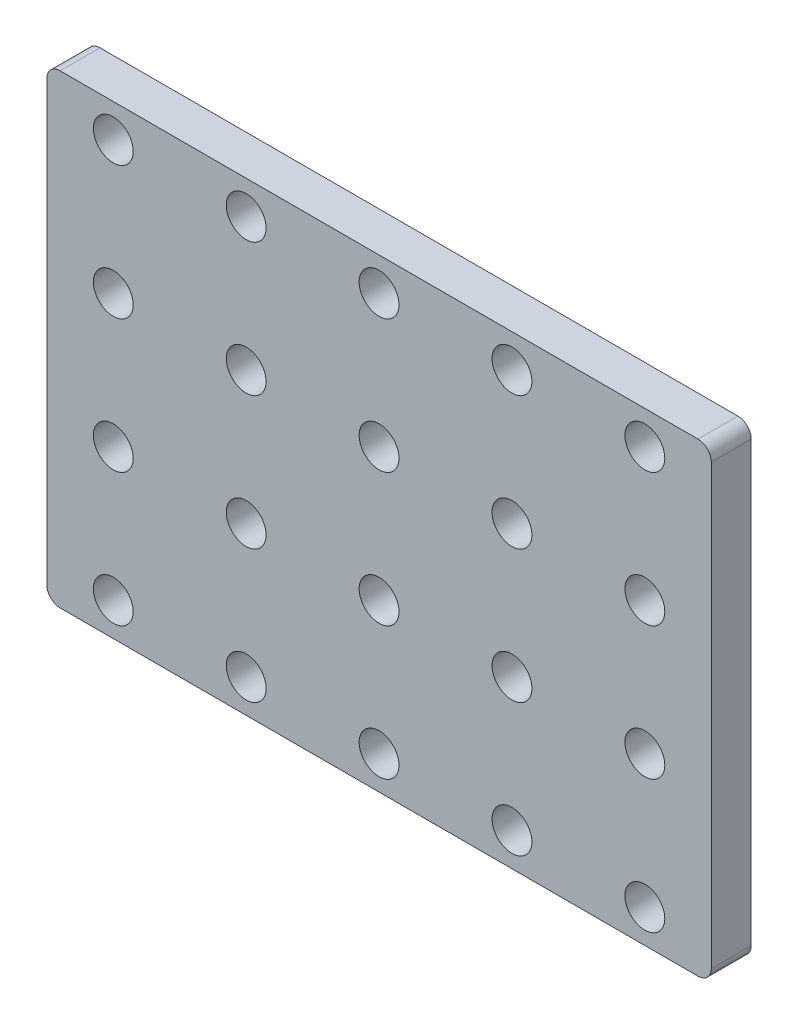
ISO-10303-21;
HEADER;
FILE_DESCRIPTION(('STEP AP214'),'2;1');
FILE_NAME('part.step','',(''),(''),'','','');
FILE_SCHEMA(('AUTOMOTIVE_DESIGN { 1 0 10303 214 1 1 1 1 }'));
ENDSEC;
DATA;
#1=APPLICATION_CONTEXT('core data for automotive mechanical design processes');
#2=APPLICATION_PROTOCOL_DEFINITION('international standard','automotive_design',2000,#1);
#3=PRODUCT_CONTEXT('',#1,'mechanical');
#4=PRODUCT('Part','Part','',(#3));
#5=PRODUCT_RELATED_PRODUCT_CATEGORY('part','',(#4));
#6=PRODUCT_DEFINITION_FORMATION('','',#4);
#7=PRODUCT_DEFINITION_CONTEXT('part definition',#1,'design');
#8=PRODUCT_DEFINITION('design','',#6,#7);
#9=PRODUCT_DEFINITION_SHAPE('','',#8);
#10=(LENGTH_UNIT() NAMED_UNIT(*) SI_UNIT(.MILLI.,.METRE.));
#11=(NAMED_UNIT(*) PLANE_ANGLE_UNIT() SI_UNIT($,.RADIAN.));
#12=(NAMED_UNIT(*) SI_UNIT($,.STERADIAN.) SOLID_ANGLE_UNIT());
#13=UNCERTAINTY_MEASURE_WITH_UNIT(LENGTH_MEASURE(1.E-05),#10,'distance_accuracy_value','');
#14=(GEOMETRIC_REPRESENTATION_CONTEXT(3) GLOBAL_UNCERTAINTY_ASSIGNED_CONTEXT((#13)) GLOBAL_UNIT_ASSIGNED_CONTEXT((#10,
#11,#12)) REPRESENTATION_CONTEXT('',''));
#15=CARTESIAN_POINT('',(0.,0.,0.));
#16=DIRECTION('',(0.,0.,1.));
#17=DIRECTION('',(1.,0.,0.));
#18=AXIS2_PLACEMENT_3D('',#15,#16,#17);
#19=CARTESIAN_POINT('',(0.,0.,3.));
#20=DIRECTION('',(1.,0.,0.));
#21=DIRECTION('',(0.,1.,0.));
#22=AXIS2_PLACEMENT_3D('',#19,#20,#21);
#23=PLANE('',#22);
#24=DIRECTION('',(0.,-1.,0.));
#25=VECTOR('',#24,1.);
#26=CARTESIAN_POINT('',(0.,0.,0.));
#27=LINE('',#26,#25);
#28=CARTESIAN_POINT('',(0.,34.,0.));
#29=VERTEX_POINT('',#28);
#30=CARTESIAN_POINT('',(0.,1.,0.));
#31=VERTEX_POINT('',#30);
#32=EDGE_CURVE('E136',#29,#31,#27,.T.);
#33=ORIENTED_EDGE('',*,*,#32,.T.);
#34=DIRECTION('',(0.,0.,-1.));
#35=VECTOR('',#34,1.);
#36=CARTESIAN_POINT('',(0.,1.,3.));
#37=LINE('',#36,#35);
#38=CARTESIAN_POINT('',(0.,1.,3.));
#39=VERTEX_POINT('',#38);
#40=EDGE_CURVE('E111',#31,#39,#37,.F.);
#41=ORIENTED_EDGE('',*,*,#40,.T.);
#42=DIRECTION('',(0.,-1.,0.));
#43=VECTOR('',#42,1.);
#44=CARTESIAN_POINT('',(0.,0.,3.));
#45=LINE('',#44,#43);
#46=CARTESIAN_POINT('',(0.,34.,3.));
#47=VERTEX_POINT('',#46);
#48=EDGE_CURVE('E149',#47,#39,#45,.T.);
#49=ORIENTED_EDGE('',*,*,#48,.F.);
#50=DIRECTION('',(0.,0.,-1.));
#51=VECTOR('',#50,1.);
#52=CARTESIAN_POINT('',(0.,34.,3.));
#53=LINE('',#52,#51);
#54=EDGE_CURVE('E117',#47,#29,#53,.T.);
#55=ORIENTED_EDGE('',*,*,#54,.T.);
#56=EDGE_LOOP('',(#33,#41,#49,#55));
#57=FACE_BOUND('',#56,.T.);
#58=ADVANCED_FACE('F39',(#57),#23,.F.);
#59=CARTESIAN_POINT('',(0.,0.,3.));
#60=DIRECTION('',(0.,1.,0.));
#61=DIRECTION('',(0.,0.,1.));
#62=AXIS2_PLACEMENT_3D('',#59,#60,#61);
#63=PLANE('',#62);
#64=DIRECTION('',(1.,0.,0.));
#65=VECTOR('',#64,1.);
#66=CARTESIAN_POINT('',(0.,0.,3.));
#67=LINE('',#66,#65);
#68=CARTESIAN_POINT('',(1.,0.,3.));
#69=VERTEX_POINT('',#68);
#70=CARTESIAN_POINT('',(49.,0.,3.));
#71=VERTEX_POINT('',#70);
#72=EDGE_CURVE('E127',#69,#71,#67,.T.);
#73=ORIENTED_EDGE('',*,*,#72,.F.);
#74=DIRECTION('',(0.,0.,-1.));
#75=VECTOR('',#74,1.);
#76=CARTESIAN_POINT('',(1.,0.,3.));
#77=LINE('',#76,#75);
#78=CARTESIAN_POINT('',(1.,0.,0.));
#79=VERTEX_POINT('',#78);
#80=EDGE_CURVE('E110',#69,#79,#77,.T.);
#81=ORIENTED_EDGE('',*,*,#80,.T.);
#82=DIRECTION('',(1.,0.,0.));
#83=VECTOR('',#82,1.);
#84=CARTESIAN_POINT('',(0.,0.,0.));
#85=LINE('',#84,#83);
#86=CARTESIAN_POINT('',(49.,0.,0.));
#87=VERTEX_POINT('',#86);
#88=EDGE_CURVE('E124',#79,#87,#85,.T.);
#89=ORIENTED_EDGE('',*,*,#88,.T.);
#90=DIRECTION('',(0.,0.,-1.));
#91=VECTOR('',#90,1.);
#92=CARTESIAN_POINT('',(49.,0.,3.));
#93=LINE('',#92,#91);
#94=EDGE_CURVE('E130',#87,#71,#93,.F.);
#95=ORIENTED_EDGE('',*,*,#94,.T.);
#96=EDGE_LOOP('',(#73,#81,#89,#95));
#97=FACE_BOUND('',#96,.T.);
#98=ADVANCED_FACE('F123',(#97),#63,.F.);
#99=CARTESIAN_POINT('',(50.,0.,3.));
#100=DIRECTION('',(-1.,0.,0.));
#101=DIRECTION('',(0.,-1.,0.));
#102=AXIS2_PLACEMENT_3D('',#99,#100,#101);
#103=PLANE('',#102);
#104=DIRECTION('',(0.,1.,0.));
#105=VECTOR('',#104,1.);
#106=CARTESIAN_POINT('',(50.,0.,3.));
#107=LINE('',#106,#105);
#108=CARTESIAN_POINT('',(50.,1.,3.));
#109=VERTEX_POINT('',#108);
#110=CARTESIAN_POINT('',(50.,34.,3.));
#111=VERTEX_POINT('',#110);
#112=EDGE_CURVE('E185',#109,#111,#107,.T.);
#113=ORIENTED_EDGE('',*,*,#112,.F.);
#114=DIRECTION('',(0.,0.,-1.));
#115=VECTOR('',#114,1.);
#116=CARTESIAN_POINT('',(50.,1.,3.));
#117=LINE('',#116,#115);
#118=CARTESIAN_POINT('',(50.,1.,0.));
#119=VERTEX_POINT('',#118);
#120=EDGE_CURVE('E179',#109,#119,#117,.T.);
#121=ORIENTED_EDGE('',*,*,#120,.T.);
#122=DIRECTION('',(0.,1.,0.));
#123=VECTOR('',#122,1.);
#124=CARTESIAN_POINT('',(50.,0.,0.));
#125=LINE('',#124,#123);
#126=CARTESIAN_POINT('',(50.,34.,0.));
#127=VERTEX_POINT('',#126);
#128=EDGE_CURVE('E135',#119,#127,#125,.T.);
#129=ORIENTED_EDGE('',*,*,#128,.T.);
#130=DIRECTION('',(0.,0.,-1.));
#131=VECTOR('',#130,1.);
#132=CARTESIAN_POINT('',(50.,34.,3.));
#133=LINE('',#132,#131);
#134=EDGE_CURVE('E176',#127,#111,#133,.F.);
#135=ORIENTED_EDGE('',*,*,#134,.T.);
#136=EDGE_LOOP('',(#113,#121,#129,#135));
#137=FACE_BOUND('',#136,.T.);
#138=ADVANCED_FACE('F388',(#137),#103,.F.);
#139=CARTESIAN_POINT('',(0.,35.,3.));
#140=DIRECTION('',(0.,-1.,0.));
#141=DIRECTION('',(0.,0.,-1.));
#142=AXIS2_PLACEMENT_3D('',#139,#140,#141);
#143=PLANE('',#142);
#144=DIRECTION('',(-1.,0.,0.));
#145=VECTOR('',#144,1.);
#146=CARTESIAN_POINT('',(0.,35.,3.));
#147=LINE('',#146,#145);
#148=CARTESIAN_POINT('',(49.,35.,3.));
#149=VERTEX_POINT('',#148);
#150=CARTESIAN_POINT('',(0.999999999999987,35.,3.));
#151=VERTEX_POINT('',#150);
#152=EDGE_CURVE('E151',#149,#151,#147,.T.);
#153=ORIENTED_EDGE('',*,*,#152,.F.);
#154=DIRECTION('',(0.,0.,-1.));
#155=VECTOR('',#154,1.);
#156=CARTESIAN_POINT('',(49.,35.,3.));
#157=LINE('',#156,#155);
#158=CARTESIAN_POINT('',(49.,35.,0.));
#159=VERTEX_POINT('',#158);
#160=EDGE_CURVE('E11',#149,#159,#157,.T.);
#161=ORIENTED_EDGE('',*,*,#160,.T.);
#162=DIRECTION('',(-1.,0.,0.));
#163=VECTOR('',#162,1.);
#164=CARTESIAN_POINT('',(0.,35.,0.));
#165=LINE('',#164,#163);
#166=CARTESIAN_POINT('',(0.999999999999987,35.,0.));
#167=VERTEX_POINT('',#166);
#168=EDGE_CURVE('E141',#159,#167,#165,.T.);
#169=ORIENTED_EDGE('',*,*,#168,.T.);
#170=DIRECTION('',(0.,0.,-1.));
#171=VECTOR('',#170,1.);
#172=CARTESIAN_POINT('',(0.999999999999987,35.,3.));
#173=LINE('',#172,#171);
#174=EDGE_CURVE('E48',#167,#151,#173,.F.);
#175=ORIENTED_EDGE('',*,*,#174,.T.);
#176=EDGE_LOOP('',(#153,#161,#169,#175));
#177=FACE_BOUND('',#176,.T.);
#178=ADVANCED_FACE('F367',(#177),#143,.F.);
#179=CARTESIAN_POINT('',(0.,0.,3.));
#180=DIRECTION('',(0.,0.,-1.));
#181=DIRECTION('',(-1.,0.,0.));
#182=AXIS2_PLACEMENT_3D('',#179,#180,#181);
#183=PLANE('',#182);
#184=CARTESIAN_POINT('',(5.0000000000003,2.5,3.));
#185=DIRECTION('',(0.,0.,1.));
#186=DIRECTION('',(1.,0.,0.));
#187=AXIS2_PLACEMENT_3D('',#184,#185,#186);
#188=CIRCLE('',#187,1.5);
#189=CARTESIAN_POINT('',(6.5000000000003,2.5,3.));
#190=VERTEX_POINT('',#189);
#191=EDGE_CURVE('E202',#190,#190,#188,.T.);
#192=ORIENTED_EDGE('',*,*,#191,.F.);
#193=EDGE_LOOP('',(#192));
#194=FACE_BOUND('',#193,.T.);
#195=CARTESIAN_POINT('',(5.0000000000002,12.5,3.));
#196=DIRECTION('',(0.,0.,1.));
#197=DIRECTION('',(1.,0.,0.));
#198=AXIS2_PLACEMENT_3D('',#195,#196,#197);
#199=CIRCLE('',#198,1.5);
#200=CARTESIAN_POINT('',(6.5000000000002,12.5,3.));
#201=VERTEX_POINT('',#200);
#202=EDGE_CURVE('E210',#201,#201,#199,.T.);
#203=ORIENTED_EDGE('',*,*,#202,.F.);
#204=EDGE_LOOP('',(#203));
#205=FACE_BOUND('',#204,.T.);
#206=CARTESIAN_POINT('',(5.00000000000009,22.5,3.));
#207=DIRECTION('',(0.,0.,1.));
#208=DIRECTION('',(1.,0.,0.));
#209=AXIS2_PLACEMENT_3D('',#206,#207,#208);
#210=CIRCLE('',#209,1.5);
#211=CARTESIAN_POINT('',(6.50000000000009,22.5,3.));
#212=VERTEX_POINT('',#211);
#213=EDGE_CURVE('E218',#212,#212,#210,.T.);
#214=ORIENTED_EDGE('',*,*,#213,.F.);
#215=EDGE_LOOP('',(#214));
#216=FACE_BOUND('',#215,.T.);
#217=CARTESIAN_POINT('',(45.0000000000003,2.5,3.));
#218=DIRECTION('',(0.,0.,1.));
#219=DIRECTION('',(1.,0.,0.));
#220=AXIS2_PLACEMENT_3D('',#217,#218,#219);
#221=CIRCLE('',#220,1.5);
#222=CARTESIAN_POINT('',(46.5000000000003,2.5,3.));
#223=VERTEX_POINT('',#222);
#224=EDGE_CURVE('E226',#223,#223,#221,.T.);
#225=ORIENTED_EDGE('',*,*,#224,.F.);
#226=EDGE_LOOP('',(#225));
#227=FACE_BOUND('',#226,.T.);
#228=CARTESIAN_POINT('',(35.0000000000003,2.5,3.));
#229=DIRECTION('',(0.,0.,1.));
#230=DIRECTION('',(1.,0.,0.));
#231=AXIS2_PLACEMENT_3D('',#228,#229,#230);
#232=CIRCLE('',#231,1.5);
#233=CARTESIAN_POINT('',(36.5000000000003,2.5,3.));
#234=VERTEX_POINT('',#233);
#235=EDGE_CURVE('E234',#234,#234,#232,.T.);
#236=ORIENTED_EDGE('',*,*,#235,.F.);
#237=EDGE_LOOP('',(#236));
#238=FACE_BOUND('',#237,.T.);
#239=CARTESIAN_POINT('',(25.0000000000003,2.5,3.));
#240=DIRECTION('',(0.,0.,1.));
#241=DIRECTION('',(1.,0.,0.));
#242=AXIS2_PLACEMENT_3D('',#239,#240,#241);
#243=CIRCLE('',#242,1.5);
#244=CARTESIAN_POINT('',(26.5000000000003,2.5,3.));
#245=VERTEX_POINT('',#244);
#246=EDGE_CURVE('E242',#245,#245,#243,.T.);
#247=ORIENTED_EDGE('',*,*,#246,.F.);
#248=EDGE_LOOP('',(#247));
#249=FACE_BOUND('',#248,.T.);
#250=CARTESIAN_POINT('',(15.0000000000003,2.5,3.));
#251=DIRECTION('',(0.,0.,1.));
#252=DIRECTION('',(1.,0.,0.));
#253=AXIS2_PLACEMENT_3D('',#250,#251,#252);
#254=CIRCLE('',#253,1.5);
#255=CARTESIAN_POINT('',(16.5000000000003,2.5,3.));
#256=VERTEX_POINT('',#255);
#257=EDGE_CURVE('E250',#256,#256,#254,.T.);
#258=ORIENTED_EDGE('',*,*,#257,.F.);
#259=EDGE_LOOP('',(#258));
#260=FACE_BOUND('',#259,.T.);
#261=CARTESIAN_POINT('',(45.0000000000002,12.5,3.));
#262=DIRECTION('',(0.,0.,1.));
#263=DIRECTION('',(1.,0.,0.));
#264=AXIS2_PLACEMENT_3D('',#261,#262,#263);
#265=CIRCLE('',#264,1.5);
#266=CARTESIAN_POINT('',(46.5000000000002,12.5,3.));
#267=VERTEX_POINT('',#266);
#268=EDGE_CURVE('E258',#267,#267,#265,.T.);
#269=ORIENTED_EDGE('',*,*,#268,.F.);
#270=EDGE_LOOP('',(#269));
#271=FACE_BOUND('',#270,.T.);
#272=CARTESIAN_POINT('',(35.0000000000002,12.5,3.));
#273=DIRECTION('',(0.,0.,1.));
#274=DIRECTION('',(1.,0.,0.));
#275=AXIS2_PLACEMENT_3D('',#272,#273,#274);
#276=CIRCLE('',#275,1.5);
#277=CARTESIAN_POINT('',(36.5000000000002,12.5,3.));
#278=VERTEX_POINT('',#277);
#279=EDGE_CURVE('E266',#278,#278,#276,.T.);
#280=ORIENTED_EDGE('',*,*,#279,.F.);
#281=EDGE_LOOP('',(#280));
#282=FACE_BOUND('',#281,.T.);
#283=CARTESIAN_POINT('',(25.0000000000002,12.5,3.));
#284=DIRECTION('',(0.,0.,1.));
#285=DIRECTION('',(1.,0.,0.));
#286=AXIS2_PLACEMENT_3D('',#283,#284,#285);
#287=CIRCLE('',#286,1.5);
#288=CARTESIAN_POINT('',(26.5000000000002,12.5,3.));
#289=VERTEX_POINT('',#288);
#290=EDGE_CURVE('E274',#289,#289,#287,.T.);
#291=ORIENTED_EDGE('',*,*,#290,.F.);
#292=EDGE_LOOP('',(#291));
#293=FACE_BOUND('',#292,.T.);
#294=CARTESIAN_POINT('',(15.0000000000002,12.5,3.));
#295=DIRECTION('',(0.,0.,1.));
#296=DIRECTION('',(1.,0.,0.));
#297=AXIS2_PLACEMENT_3D('',#294,#295,#296);
#298=CIRCLE('',#297,1.5);
#299=CARTESIAN_POINT('',(16.5000000000002,12.5,3.));
#300=VERTEX_POINT('',#299);
#301=EDGE_CURVE('E282',#300,#300,#298,.T.);
#302=ORIENTED_EDGE('',*,*,#301,.F.);
#303=EDGE_LOOP('',(#302));
#304=FACE_BOUND('',#303,.T.);
#305=CARTESIAN_POINT('',(45.0000000000001,22.5,3.));
#306=DIRECTION('',(0.,0.,1.));
#307=DIRECTION('',(1.,0.,0.));
#308=AXIS2_PLACEMENT_3D('',#305,#306,#307);
#309=CIRCLE('',#308,1.5);
#310=CARTESIAN_POINT('',(46.5000000000001,22.5,3.));
#311=VERTEX_POINT('',#310);
#312=EDGE_CURVE('E290',#311,#311,#309,.T.);
#313=ORIENTED_EDGE('',*,*,#312,.F.);
#314=EDGE_LOOP('',(#313));
#315=FACE_BOUND('',#314,.T.);
#316=CARTESIAN_POINT('',(35.0000000000001,22.5,3.));
#317=DIRECTION('',(0.,0.,1.));
#318=DIRECTION('',(1.,0.,0.));
#319=AXIS2_PLACEMENT_3D('',#316,#317,#318);
#320=CIRCLE('',#319,1.5);
#321=CARTESIAN_POINT('',(36.5000000000001,22.5,3.));
#322=VERTEX_POINT('',#321);
#323=EDGE_CURVE('E298',#322,#322,#320,.T.);
#324=ORIENTED_EDGE('',*,*,#323,.F.);
#325=EDGE_LOOP('',(#324));
#326=FACE_BOUND('',#325,.T.);
#327=CARTESIAN_POINT('',(25.0000000000001,22.5,3.));
#328=DIRECTION('',(0.,0.,1.));
#329=DIRECTION('',(1.,0.,0.));
#330=AXIS2_PLACEMENT_3D('',#327,#328,#329);
#331=CIRCLE('',#330,1.5);
#332=CARTESIAN_POINT('',(26.5000000000001,22.5,3.));
#333=VERTEX_POINT('',#332);
#334=EDGE_CURVE('E306',#333,#333,#331,.T.);
#335=ORIENTED_EDGE('',*,*,#334,.F.);
#336=EDGE_LOOP('',(#335));
#337=FACE_BOUND('',#336,.T.);
#338=CARTESIAN_POINT('',(15.0000000000001,22.5,3.));
#339=DIRECTION('',(0.,0.,1.));
#340=DIRECTION('',(1.,0.,0.));
#341=AXIS2_PLACEMENT_3D('',#338,#339,#340);
#342=CIRCLE('',#341,1.5);
#343=CARTESIAN_POINT('',(16.5000000000001,22.5,3.));
#344=VERTEX_POINT('',#343);
#345=EDGE_CURVE('E314',#344,#344,#342,.T.);
#346=ORIENTED_EDGE('',*,*,#345,.F.);
#347=EDGE_LOOP('',(#346));
#348=FACE_BOUND('',#347,.T.);
#349=CARTESIAN_POINT('',(45.,32.5,3.));
#350=DIRECTION('',(0.,0.,1.));
#351=DIRECTION('',(1.,0.,0.));
#352=AXIS2_PLACEMENT_3D('',#349,#350,#351);
#353=CIRCLE('',#352,1.5);
#354=CARTESIAN_POINT('',(46.5,32.5,3.));
#355=VERTEX_POINT('',#354);
#356=EDGE_CURVE('E322',#355,#355,#353,.T.);
#357=ORIENTED_EDGE('',*,*,#356,.F.);
#358=EDGE_LOOP('',(#357));
#359=FACE_BOUND('',#358,.T.);
#360=CARTESIAN_POINT('',(35.,32.5,3.));
#361=DIRECTION('',(0.,0.,1.));
#362=DIRECTION('',(1.,0.,0.));
#363=AXIS2_PLACEMENT_3D('',#360,#361,#362);
#364=CIRCLE('',#363,1.5);
#365=CARTESIAN_POINT('',(36.5,32.5,3.));
#366=VERTEX_POINT('',#365);
#367=EDGE_CURVE('E330',#366,#366,#364,.T.);
#368=ORIENTED_EDGE('',*,*,#367,.F.);
#369=EDGE_LOOP('',(#368));
#370=FACE_BOUND('',#369,.T.);
#371=CARTESIAN_POINT('',(25.,32.5,3.));
#372=DIRECTION('',(0.,0.,1.));
#373=DIRECTION('',(1.,0.,0.));
#374=AXIS2_PLACEMENT_3D('',#371,#372,#373);
#375=CIRCLE('',#374,1.5);
#376=CARTESIAN_POINT('',(26.5,32.5,3.));
#377=VERTEX_POINT('',#376);
#378=EDGE_CURVE('E338',#377,#377,#375,.T.);
#379=ORIENTED_EDGE('',*,*,#378,.F.);
#380=EDGE_LOOP('',(#379));
#381=FACE_BOUND('',#380,.T.);
#382=CARTESIAN_POINT('',(15.,32.5,3.));
#383=DIRECTION('',(0.,0.,1.));
#384=DIRECTION('',(1.,0.,0.));
#385=AXIS2_PLACEMENT_3D('',#382,#383,#384);
#386=CIRCLE('',#385,1.5);
#387=CARTESIAN_POINT('',(16.5,32.5,3.));
#388=VERTEX_POINT('',#387);
#389=EDGE_CURVE('E346',#388,#388,#386,.T.);
#390=ORIENTED_EDGE('',*,*,#389,.F.);
#391=EDGE_LOOP('',(#390));
#392=FACE_BOUND('',#391,.T.);
#393=CARTESIAN_POINT('',(4.99999999999999,32.5,3.));
#394=DIRECTION('',(0.,0.,1.));
#395=DIRECTION('',(1.,0.,0.));
#396=AXIS2_PLACEMENT_3D('',#393,#394,#395);
#397=CIRCLE('',#396,1.5);
#398=CARTESIAN_POINT('',(6.49999999999999,32.5,3.));
#399=VERTEX_POINT('',#398);
#400=EDGE_CURVE('E194',#399,#399,#397,.T.);
#401=ORIENTED_EDGE('',*,*,#400,.F.);
#402=EDGE_LOOP('',(#401));
#403=FACE_BOUND('',#402,.T.);
#404=ORIENTED_EDGE('',*,*,#48,.T.);
#405=CARTESIAN_POINT('',(1.,1.,3.));
#406=DIRECTION('',(0.,0.,-1.));
#407=DIRECTION('',(-1.,0.,0.));
#408=AXIS2_PLACEMENT_3D('',#405,#406,#407);
#409=CIRCLE('',#408,1.);
#410=EDGE_CURVE('E173',#39,#69,#409,.F.);
#411=ORIENTED_EDGE('',*,*,#410,.T.);
#412=ORIENTED_EDGE('',*,*,#72,.T.);
#413=CARTESIAN_POINT('',(49.,1.,3.));
#414=DIRECTION('',(0.,0.,-1.));
#415=DIRECTION('',(-1.,0.,0.));
#416=AXIS2_PLACEMENT_3D('',#413,#414,#415);
#417=CIRCLE('',#416,1.);
#418=EDGE_CURVE('E170',#71,#109,#417,.F.);
#419=ORIENTED_EDGE('',*,*,#418,.T.);
#420=ORIENTED_EDGE('',*,*,#112,.T.);
#421=CARTESIAN_POINT('',(49.,34.,3.));
#422=DIRECTION('',(0.,0.,-1.));
#423=DIRECTION('',(-1.,0.,0.));
#424=AXIS2_PLACEMENT_3D('',#421,#422,#423);
#425=CIRCLE('',#424,1.);
#426=EDGE_CURVE('E61',#111,#149,#425,.F.);
#427=ORIENTED_EDGE('',*,*,#426,.T.);
#428=ORIENTED_EDGE('',*,*,#152,.T.);
#429=CARTESIAN_POINT('',(0.999999999999987,34.,3.));
#430=DIRECTION('',(0.,0.,-1.));
#431=DIRECTION('',(-1.,0.,0.));
#432=AXIS2_PLACEMENT_3D('',#429,#430,#431);
#433=CIRCLE('',#432,1.);
#434=EDGE_CURVE('E165',#151,#47,#433,.F.);
#435=ORIENTED_EDGE('',*,*,#434,.T.);
#436=EDGE_LOOP('',(#404,#411,#412,#419,#420,#427,#428,#435));
#437=FACE_BOUND('',#436,.T.);
#438=ADVANCED_FACE('F364',(#194,#205,#216,#227,#238,#249,#260,#271,#282,#293,#304,#315,#326,
#337,#348,#359,#370,#381,#392,#403,#437),#183,.F.);
#439=CARTESIAN_POINT('',(0.,0.,0.));
#440=DIRECTION('',(0.,0.,-1.));
#441=DIRECTION('',(-1.,0.,0.));
#442=AXIS2_PLACEMENT_3D('',#439,#440,#441);
#443=PLANE('',#442);
#444=CARTESIAN_POINT('',(5.0000000000003,2.5,0.));
#445=DIRECTION('',(0.,0.,1.));
#446=DIRECTION('',(1.,0.,0.));
#447=AXIS2_PLACEMENT_3D('',#444,#445,#446);
#448=CIRCLE('',#447,1.5);
#449=CARTESIAN_POINT('',(6.5000000000003,2.5,0.));
#450=VERTEX_POINT('',#449);
#451=EDGE_CURVE('E206',#450,#450,#448,.T.);
#452=ORIENTED_EDGE('',*,*,#451,.T.);
#453=EDGE_LOOP('',(#452));
#454=FACE_BOUND('',#453,.T.);
#455=CARTESIAN_POINT('',(5.0000000000002,12.5,0.));
#456=DIRECTION('',(0.,0.,1.));
#457=DIRECTION('',(1.,0.,0.));
#458=AXIS2_PLACEMENT_3D('',#455,#456,#457);
#459=CIRCLE('',#458,1.5);
#460=CARTESIAN_POINT('',(6.5000000000002,12.5,0.));
#461=VERTEX_POINT('',#460);
#462=EDGE_CURVE('E214',#461,#461,#459,.T.);
#463=ORIENTED_EDGE('',*,*,#462,.T.);
#464=EDGE_LOOP('',(#463));
#465=FACE_BOUND('',#464,.T.);
#466=CARTESIAN_POINT('',(5.00000000000009,22.5,0.));
#467=DIRECTION('',(0.,0.,1.));
#468=DIRECTION('',(1.,0.,0.));
#469=AXIS2_PLACEMENT_3D('',#466,#467,#468);
#470=CIRCLE('',#469,1.5);
#471=CARTESIAN_POINT('',(6.50000000000009,22.5,0.));
#472=VERTEX_POINT('',#471);
#473=EDGE_CURVE('E222',#472,#472,#470,.T.);
#474=ORIENTED_EDGE('',*,*,#473,.T.);
#475=EDGE_LOOP('',(#474));
#476=FACE_BOUND('',#475,.T.);
#477=CARTESIAN_POINT('',(45.0000000000003,2.5,0.));
#478=DIRECTION('',(0.,0.,1.));
#479=DIRECTION('',(1.,0.,0.));
#480=AXIS2_PLACEMENT_3D('',#477,#478,#479);
#481=CIRCLE('',#480,1.5);
#482=CARTESIAN_POINT('',(46.5000000000003,2.5,0.));
#483=VERTEX_POINT('',#482);
#484=EDGE_CURVE('E230',#483,#483,#481,.T.);
#485=ORIENTED_EDGE('',*,*,#484,.T.);
#486=EDGE_LOOP('',(#485));
#487=FACE_BOUND('',#486,.T.);
#488=CARTESIAN_POINT('',(35.0000000000003,2.5,0.));
#489=DIRECTION('',(0.,0.,1.));
#490=DIRECTION('',(1.,0.,0.));
#491=AXIS2_PLACEMENT_3D('',#488,#489,#490);
#492=CIRCLE('',#491,1.5);
#493=CARTESIAN_POINT('',(36.5000000000003,2.5,0.));
#494=VERTEX_POINT('',#493);
#495=EDGE_CURVE('E238',#494,#494,#492,.T.);
#496=ORIENTED_EDGE('',*,*,#495,.T.);
#497=EDGE_LOOP('',(#496));
#498=FACE_BOUND('',#497,.T.);
#499=CARTESIAN_POINT('',(25.0000000000003,2.5,0.));
#500=DIRECTION('',(0.,0.,1.));
#501=DIRECTION('',(1.,0.,0.));
#502=AXIS2_PLACEMENT_3D('',#499,#500,#501);
#503=CIRCLE('',#502,1.5);
#504=CARTESIAN_POINT('',(26.5000000000003,2.5,0.));
#505=VERTEX_POINT('',#504);
#506=EDGE_CURVE('E246',#505,#505,#503,.T.);
#507=ORIENTED_EDGE('',*,*,#506,.T.);
#508=EDGE_LOOP('',(#507));
#509=FACE_BOUND('',#508,.T.);
#510=CARTESIAN_POINT('',(15.0000000000003,2.5,0.));
#511=DIRECTION('',(0.,0.,1.));
#512=DIRECTION('',(1.,0.,0.));
#513=AXIS2_PLACEMENT_3D('',#510,#511,#512);
#514=CIRCLE('',#513,1.5);
#515=CARTESIAN_POINT('',(16.5000000000003,2.5,0.));
#516=VERTEX_POINT('',#515);
#517=EDGE_CURVE('E254',#516,#516,#514,.T.);
#518=ORIENTED_EDGE('',*,*,#517,.T.);
#519=EDGE_LOOP('',(#518));
#520=FACE_BOUND('',#519,.T.);
#521=CARTESIAN_POINT('',(45.0000000000002,12.5,0.));
#522=DIRECTION('',(0.,0.,1.));
#523=DIRECTION('',(1.,0.,0.));
#524=AXIS2_PLACEMENT_3D('',#521,#522,#523);
#525=CIRCLE('',#524,1.5);
#526=CARTESIAN_POINT('',(46.5000000000002,12.5,0.));
#527=VERTEX_POINT('',#526);
#528=EDGE_CURVE('E262',#527,#527,#525,.T.);
#529=ORIENTED_EDGE('',*,*,#528,.T.);
#530=EDGE_LOOP('',(#529));
#531=FACE_BOUND('',#530,.T.);
#532=CARTESIAN_POINT('',(35.0000000000002,12.5,0.));
#533=DIRECTION('',(0.,0.,1.));
#534=DIRECTION('',(1.,0.,0.));
#535=AXIS2_PLACEMENT_3D('',#532,#533,#534);
#536=CIRCLE('',#535,1.5);
#537=CARTESIAN_POINT('',(36.5000000000002,12.5,0.));
#538=VERTEX_POINT('',#537);
#539=EDGE_CURVE('E270',#538,#538,#536,.T.);
#540=ORIENTED_EDGE('',*,*,#539,.T.);
#541=EDGE_LOOP('',(#540));
#542=FACE_BOUND('',#541,.T.);
#543=CARTESIAN_POINT('',(25.0000000000002,12.5,0.));
#544=DIRECTION('',(0.,0.,1.));
#545=DIRECTION('',(1.,0.,0.));
#546=AXIS2_PLACEMENT_3D('',#543,#544,#545);
#547=CIRCLE('',#546,1.5);
#548=CARTESIAN_POINT('',(26.5000000000002,12.5,0.));
#549=VERTEX_POINT('',#548);
#550=EDGE_CURVE('E278',#549,#549,#547,.T.);
#551=ORIENTED_EDGE('',*,*,#550,.T.);
#552=EDGE_LOOP('',(#551));
#553=FACE_BOUND('',#552,.T.);
#554=CARTESIAN_POINT('',(15.0000000000002,12.5,0.));
#555=DIRECTION('',(0.,0.,1.));
#556=DIRECTION('',(1.,0.,0.));
#557=AXIS2_PLACEMENT_3D('',#554,#555,#556);
#558=CIRCLE('',#557,1.5);
#559=CARTESIAN_POINT('',(16.5000000000002,12.5,0.));
#560=VERTEX_POINT('',#559);
#561=EDGE_CURVE('E286',#560,#560,#558,.T.);
#562=ORIENTED_EDGE('',*,*,#561,.T.);
#563=EDGE_LOOP('',(#562));
#564=FACE_BOUND('',#563,.T.);
#565=CARTESIAN_POINT('',(45.0000000000001,22.5,0.));
#566=DIRECTION('',(0.,0.,1.));
#567=DIRECTION('',(1.,0.,0.));
#568=AXIS2_PLACEMENT_3D('',#565,#566,#567);
#569=CIRCLE('',#568,1.5);
#570=CARTESIAN_POINT('',(46.5000000000001,22.5,0.));
#571=VERTEX_POINT('',#570);
#572=EDGE_CURVE('E294',#571,#571,#569,.T.);
#573=ORIENTED_EDGE('',*,*,#572,.T.);
#574=EDGE_LOOP('',(#573));
#575=FACE_BOUND('',#574,.T.);
#576=CARTESIAN_POINT('',(35.0000000000001,22.5,0.));
#577=DIRECTION('',(0.,0.,1.));
#578=DIRECTION('',(1.,0.,0.));
#579=AXIS2_PLACEMENT_3D('',#576,#577,#578);
#580=CIRCLE('',#579,1.5);
#581=CARTESIAN_POINT('',(36.5000000000001,22.5,0.));
#582=VERTEX_POINT('',#581);
#583=EDGE_CURVE('E302',#582,#582,#580,.T.);
#584=ORIENTED_EDGE('',*,*,#583,.T.);
#585=EDGE_LOOP('',(#584));
#586=FACE_BOUND('',#585,.T.);
#587=CARTESIAN_POINT('',(25.0000000000001,22.5,0.));
#588=DIRECTION('',(0.,0.,1.));
#589=DIRECTION('',(1.,0.,0.));
#590=AXIS2_PLACEMENT_3D('',#587,#588,#589);
#591=CIRCLE('',#590,1.5);
#592=CARTESIAN_POINT('',(26.5000000000001,22.5,0.));
#593=VERTEX_POINT('',#592);
#594=EDGE_CURVE('E310',#593,#593,#591,.T.);
#595=ORIENTED_EDGE('',*,*,#594,.T.);
#596=EDGE_LOOP('',(#595));
#597=FACE_BOUND('',#596,.T.);
#598=CARTESIAN_POINT('',(15.0000000000001,22.5,0.));
#599=DIRECTION('',(0.,0.,1.));
#600=DIRECTION('',(1.,0.,0.));
#601=AXIS2_PLACEMENT_3D('',#598,#599,#600);
#602=CIRCLE('',#601,1.5);
#603=CARTESIAN_POINT('',(16.5000000000001,22.5,0.));
#604=VERTEX_POINT('',#603);
#605=EDGE_CURVE('E318',#604,#604,#602,.T.);
#606=ORIENTED_EDGE('',*,*,#605,.T.);
#607=EDGE_LOOP('',(#606));
#608=FACE_BOUND('',#607,.T.);
#609=CARTESIAN_POINT('',(45.,32.5,0.));
#610=DIRECTION('',(0.,0.,1.));
#611=DIRECTION('',(1.,0.,0.));
#612=AXIS2_PLACEMENT_3D('',#609,#610,#611);
#613=CIRCLE('',#612,1.5);
#614=CARTESIAN_POINT('',(46.5,32.5,0.));
#615=VERTEX_POINT('',#614);
#616=EDGE_CURVE('E326',#615,#615,#613,.T.);
#617=ORIENTED_EDGE('',*,*,#616,.T.);
#618=EDGE_LOOP('',(#617));
#619=FACE_BOUND('',#618,.T.);
#620=CARTESIAN_POINT('',(35.,32.5,0.));
#621=DIRECTION('',(0.,0.,1.));
#622=DIRECTION('',(1.,0.,0.));
#623=AXIS2_PLACEMENT_3D('',#620,#621,#622);
#624=CIRCLE('',#623,1.5);
#625=CARTESIAN_POINT('',(36.5,32.5,0.));
#626=VERTEX_POINT('',#625);
#627=EDGE_CURVE('E334',#626,#626,#624,.T.);
#628=ORIENTED_EDGE('',*,*,#627,.T.);
#629=EDGE_LOOP('',(#628));
#630=FACE_BOUND('',#629,.T.);
#631=CARTESIAN_POINT('',(25.,32.5,0.));
#632=DIRECTION('',(0.,0.,1.));
#633=DIRECTION('',(1.,0.,0.));
#634=AXIS2_PLACEMENT_3D('',#631,#632,#633);
#635=CIRCLE('',#634,1.5);
#636=CARTESIAN_POINT('',(26.5,32.5,0.));
#637=VERTEX_POINT('',#636);
#638=EDGE_CURVE('E342',#637,#637,#635,.T.);
#639=ORIENTED_EDGE('',*,*,#638,.T.);
#640=EDGE_LOOP('',(#639));
#641=FACE_BOUND('',#640,.T.);
#642=CARTESIAN_POINT('',(15.,32.5,0.));
#643=DIRECTION('',(0.,0.,1.));
#644=DIRECTION('',(1.,0.,0.));
#645=AXIS2_PLACEMENT_3D('',#642,#643,#644);
#646=CIRCLE('',#645,1.5);
#647=CARTESIAN_POINT('',(16.5,32.5,0.));
#648=VERTEX_POINT('',#647);
#649=EDGE_CURVE('E198',#648,#648,#646,.T.);
#650=ORIENTED_EDGE('',*,*,#649,.T.);
#651=EDGE_LOOP('',(#650));
#652=FACE_BOUND('',#651,.T.);
#653=CARTESIAN_POINT('',(4.99999999999999,32.5,0.));
#654=DIRECTION('',(0.,0.,1.));
#655=DIRECTION('',(1.,0.,0.));
#656=AXIS2_PLACEMENT_3D('',#653,#654,#655);
#657=CIRCLE('',#656,1.5);
#658=CARTESIAN_POINT('',(6.49999999999999,32.5,0.));
#659=VERTEX_POINT('',#658);
#660=EDGE_CURVE('E143',#659,#659,#657,.T.);
#661=ORIENTED_EDGE('',*,*,#660,.T.);
#662=EDGE_LOOP('',(#661));
#663=FACE_BOUND('',#662,.T.);
#664=ORIENTED_EDGE('',*,*,#88,.F.);
#665=CARTESIAN_POINT('',(1.,1.,0.));
#666=DIRECTION('',(0.,0.,-1.));
#667=DIRECTION('',(-1.,0.,0.));
#668=AXIS2_PLACEMENT_3D('',#665,#666,#667);
#669=CIRCLE('',#668,1.);
#670=EDGE_CURVE('E106',#79,#31,#669,.T.);
#671=ORIENTED_EDGE('',*,*,#670,.T.);
#672=ORIENTED_EDGE('',*,*,#32,.F.);
#673=CARTESIAN_POINT('',(0.999999999999987,34.,0.));
#674=DIRECTION('',(0.,0.,-1.));
#675=DIRECTION('',(-1.,0.,0.));
#676=AXIS2_PLACEMENT_3D('',#673,#674,#675);
#677=CIRCLE('',#676,1.);
#678=EDGE_CURVE('E129',#29,#167,#677,.T.);
#679=ORIENTED_EDGE('',*,*,#678,.T.);
#680=ORIENTED_EDGE('',*,*,#168,.F.);
#681=CARTESIAN_POINT('',(49.,34.,0.));
#682=DIRECTION('',(0.,0.,-1.));
#683=DIRECTION('',(-1.,0.,0.));
#684=AXIS2_PLACEMENT_3D('',#681,#682,#683);
#685=CIRCLE('',#684,1.);
#686=EDGE_CURVE('E155',#159,#127,#685,.T.);
#687=ORIENTED_EDGE('',*,*,#686,.T.);
#688=ORIENTED_EDGE('',*,*,#128,.F.);
#689=CARTESIAN_POINT('',(49.,1.,0.));
#690=DIRECTION('',(0.,0.,-1.));
#691=DIRECTION('',(-1.,0.,0.));
#692=AXIS2_PLACEMENT_3D('',#689,#690,#691);
#693=CIRCLE('',#692,1.);
#694=EDGE_CURVE('E118',#119,#87,#693,.T.);
#695=ORIENTED_EDGE('',*,*,#694,.T.);
#696=EDGE_LOOP('',(#664,#671,#672,#679,#680,#687,#688,#695));
#697=FACE_BOUND('',#696,.T.);
#698=ADVANCED_FACE('F132',(#454,#465,#476,#487,#498,#509,#520,#531,#542,#553,#564,#575,#586,
#597,#608,#619,#630,#641,#652,#663,#697),#443,.T.);
#699=CARTESIAN_POINT('',(4.99999999999999,32.5,0.));
#700=DIRECTION('',(0.,0.,1.));
#701=DIRECTION('',(1.,0.,0.));
#702=AXIS2_PLACEMENT_3D('',#699,#700,#701);
#703=CYLINDRICAL_SURFACE('',#702,1.5);
#704=ORIENTED_EDGE('',*,*,#660,.F.);
#705=EDGE_LOOP('',(#704));
#706=FACE_BOUND('',#705,.T.);
#707=ORIENTED_EDGE('',*,*,#400,.T.);
#708=EDGE_LOOP('',(#707));
#709=FACE_BOUND('',#708,.T.);
#710=ADVANCED_FACE('F360',(#706,#709),#703,.F.);
#711=CARTESIAN_POINT('',(15.,32.5,0.));
#712=DIRECTION('',(0.,0.,1.));
#713=DIRECTION('',(1.,0.,0.));
#714=AXIS2_PLACEMENT_3D('',#711,#712,#713);
#715=CYLINDRICAL_SURFACE('',#714,1.5);
#716=ORIENTED_EDGE('',*,*,#649,.F.);
#717=EDGE_LOOP('',(#716));
#718=FACE_BOUND('',#717,.T.);
#719=ORIENTED_EDGE('',*,*,#389,.T.);
#720=EDGE_LOOP('',(#719));
#721=FACE_BOUND('',#720,.T.);
#722=ADVANCED_FACE('F356',(#718,#721),#715,.F.);
#723=CARTESIAN_POINT('',(25.,32.5,0.));
#724=DIRECTION('',(0.,0.,1.));
#725=DIRECTION('',(1.,0.,0.));
#726=AXIS2_PLACEMENT_3D('',#723,#724,#725);
#727=CYLINDRICAL_SURFACE('',#726,1.5);
#728=ORIENTED_EDGE('',*,*,#638,.F.);
#729=EDGE_LOOP('',(#728));
#730=FACE_BOUND('',#729,.T.);
#731=ORIENTED_EDGE('',*,*,#378,.T.);
#732=EDGE_LOOP('',(#731));
#733=FACE_BOUND('',#732,.T.);
#734=ADVANCED_FACE('F359',(#730,#733),#727,.F.);
#735=CARTESIAN_POINT('',(35.,32.5,0.));
#736=DIRECTION('',(0.,0.,1.));
#737=DIRECTION('',(1.,0.,0.));
#738=AXIS2_PLACEMENT_3D('',#735,#736,#737);
#739=CYLINDRICAL_SURFACE('',#738,1.5);
#740=ORIENTED_EDGE('',*,*,#627,.F.);
#741=EDGE_LOOP('',(#740));
#742=FACE_BOUND('',#741,.T.);
#743=ORIENTED_EDGE('',*,*,#367,.T.);
#744=EDGE_LOOP('',(#743));
#745=FACE_BOUND('',#744,.T.);
#746=ADVANCED_FACE('F579',(#742,#745),#739,.F.);
#747=CARTESIAN_POINT('',(45.,32.5,0.));
#748=DIRECTION('',(0.,0.,1.));
#749=DIRECTION('',(1.,0.,0.));
#750=AXIS2_PLACEMENT_3D('',#747,#748,#749);
#751=CYLINDRICAL_SURFACE('',#750,1.5);
#752=ORIENTED_EDGE('',*,*,#616,.F.);
#753=EDGE_LOOP('',(#752));
#754=FACE_BOUND('',#753,.T.);
#755=ORIENTED_EDGE('',*,*,#356,.T.);
#756=EDGE_LOOP('',(#755));
#757=FACE_BOUND('',#756,.T.);
#758=ADVANCED_FACE('F571',(#754,#757),#751,.F.);
#759=CARTESIAN_POINT('',(15.0000000000001,22.5,0.));
#760=DIRECTION('',(0.,0.,1.));
#761=DIRECTION('',(1.,0.,0.));
#762=AXIS2_PLACEMENT_3D('',#759,#760,#761);
#763=CYLINDRICAL_SURFACE('',#762,1.5);
#764=ORIENTED_EDGE('',*,*,#605,.F.);
#765=EDGE_LOOP('',(#764));
#766=FACE_BOUND('',#765,.T.);
#767=ORIENTED_EDGE('',*,*,#345,.T.);
#768=EDGE_LOOP('',(#767));
#769=FACE_BOUND('',#768,.T.);
#770=ADVANCED_FACE('F563',(#766,#769),#763,.F.);
#771=CARTESIAN_POINT('',(25.0000000000001,22.5,0.));
#772=DIRECTION('',(0.,0.,1.));
#773=DIRECTION('',(1.,0.,0.));
#774=AXIS2_PLACEMENT_3D('',#771,#772,#773);
#775=CYLINDRICAL_SURFACE('',#774,1.5);
#776=ORIENTED_EDGE('',*,*,#594,.F.);
#777=EDGE_LOOP('',(#776));
#778=FACE_BOUND('',#777,.T.);
#779=ORIENTED_EDGE('',*,*,#334,.T.);
#780=EDGE_LOOP('',(#779));
#781=FACE_BOUND('',#780,.T.);
#782=ADVANCED_FACE('F555',(#778,#781),#775,.F.);
#783=CARTESIAN_POINT('',(35.0000000000001,22.5,0.));
#784=DIRECTION('',(0.,0.,1.));
#785=DIRECTION('',(1.,0.,0.));
#786=AXIS2_PLACEMENT_3D('',#783,#784,#785);
#787=CYLINDRICAL_SURFACE('',#786,1.5);
#788=ORIENTED_EDGE('',*,*,#583,.F.);
#789=EDGE_LOOP('',(#788));
#790=FACE_BOUND('',#789,.T.);
#791=ORIENTED_EDGE('',*,*,#323,.T.);
#792=EDGE_LOOP('',(#791));
#793=FACE_BOUND('',#792,.T.);
#794=ADVANCED_FACE('F547',(#790,#793),#787,.F.);
#795=CARTESIAN_POINT('',(45.0000000000001,22.5,0.));
#796=DIRECTION('',(0.,0.,1.));
#797=DIRECTION('',(1.,0.,0.));
#798=AXIS2_PLACEMENT_3D('',#795,#796,#797);
#799=CYLINDRICAL_SURFACE('',#798,1.5);
#800=ORIENTED_EDGE('',*,*,#572,.F.);
#801=EDGE_LOOP('',(#800));
#802=FACE_BOUND('',#801,.T.);
#803=ORIENTED_EDGE('',*,*,#312,.T.);
#804=EDGE_LOOP('',(#803));
#805=FACE_BOUND('',#804,.T.);
#806=ADVANCED_FACE('F539',(#802,#805),#799,.F.);
#807=CARTESIAN_POINT('',(15.0000000000002,12.5,0.));
#808=DIRECTION('',(0.,0.,1.));
#809=DIRECTION('',(1.,0.,0.));
#810=AXIS2_PLACEMENT_3D('',#807,#808,#809);
#811=CYLINDRICAL_SURFACE('',#810,1.5);
#812=ORIENTED_EDGE('',*,*,#561,.F.);
#813=EDGE_LOOP('',(#812));
#814=FACE_BOUND('',#813,.T.);
#815=ORIENTED_EDGE('',*,*,#301,.T.);
#816=EDGE_LOOP('',(#815));
#817=FACE_BOUND('',#816,.T.);
#818=ADVANCED_FACE('F531',(#814,#817),#811,.F.);
#819=CARTESIAN_POINT('',(25.0000000000002,12.5,0.));
#820=DIRECTION('',(0.,0.,1.));
#821=DIRECTION('',(1.,0.,0.));
#822=AXIS2_PLACEMENT_3D('',#819,#820,#821);
#823=CYLINDRICAL_SURFACE('',#822,1.5);
#824=ORIENTED_EDGE('',*,*,#550,.F.);
#825=EDGE_LOOP('',(#824));
#826=FACE_BOUND('',#825,.T.);
#827=ORIENTED_EDGE('',*,*,#290,.T.);
#828=EDGE_LOOP('',(#827));
#829=FACE_BOUND('',#828,.T.);
#830=ADVANCED_FACE('F523',(#826,#829),#823,.F.);
#831=CARTESIAN_POINT('',(35.0000000000002,12.5,0.));
#832=DIRECTION('',(0.,0.,1.));
#833=DIRECTION('',(1.,0.,0.));
#834=AXIS2_PLACEMENT_3D('',#831,#832,#833);
#835=CYLINDRICAL_SURFACE('',#834,1.5);
#836=ORIENTED_EDGE('',*,*,#539,.F.);
#837=EDGE_LOOP('',(#836));
#838=FACE_BOUND('',#837,.T.);
#839=ORIENTED_EDGE('',*,*,#279,.T.);
#840=EDGE_LOOP('',(#839));
#841=FACE_BOUND('',#840,.T.);
#842=ADVANCED_FACE('F515',(#838,#841),#835,.F.);
#843=CARTESIAN_POINT('',(45.0000000000002,12.5,0.));
#844=DIRECTION('',(0.,0.,1.));
#845=DIRECTION('',(1.,0.,0.));
#846=AXIS2_PLACEMENT_3D('',#843,#844,#845);
#847=CYLINDRICAL_SURFACE('',#846,1.5);
#848=ORIENTED_EDGE('',*,*,#528,.F.);
#849=EDGE_LOOP('',(#848));
#850=FACE_BOUND('',#849,.T.);
#851=ORIENTED_EDGE('',*,*,#268,.T.);
#852=EDGE_LOOP('',(#851));
#853=FACE_BOUND('',#852,.T.);
#854=ADVANCED_FACE('F507',(#850,#853),#847,.F.);
#855=CARTESIAN_POINT('',(15.0000000000003,2.5,0.));
#856=DIRECTION('',(0.,0.,1.));
#857=DIRECTION('',(1.,0.,0.));
#858=AXIS2_PLACEMENT_3D('',#855,#856,#857);
#859=CYLINDRICAL_SURFACE('',#858,1.5);
#860=ORIENTED_EDGE('',*,*,#517,.F.);
#861=EDGE_LOOP('',(#860));
#862=FACE_BOUND('',#861,.T.);
#863=ORIENTED_EDGE('',*,*,#257,.T.);
#864=EDGE_LOOP('',(#863));
#865=FACE_BOUND('',#864,.T.);
#866=ADVANCED_FACE('F499',(#862,#865),#859,.F.);
#867=CARTESIAN_POINT('',(25.0000000000003,2.5,0.));
#868=DIRECTION('',(0.,0.,1.));
#869=DIRECTION('',(1.,0.,0.));
#870=AXIS2_PLACEMENT_3D('',#867,#868,#869);
#871=CYLINDRICAL_SURFACE('',#870,1.5);
#872=ORIENTED_EDGE('',*,*,#506,.F.);
#873=EDGE_LOOP('',(#872));
#874=FACE_BOUND('',#873,.T.);
#875=ORIENTED_EDGE('',*,*,#246,.T.);
#876=EDGE_LOOP('',(#875));
#877=FACE_BOUND('',#876,.T.);
#878=ADVANCED_FACE('F491',(#874,#877),#871,.F.);
#879=CARTESIAN_POINT('',(35.0000000000003,2.5,0.));
#880=DIRECTION('',(0.,0.,1.));
#881=DIRECTION('',(1.,0.,0.));
#882=AXIS2_PLACEMENT_3D('',#879,#880,#881);
#883=CYLINDRICAL_SURFACE('',#882,1.5);
#884=ORIENTED_EDGE('',*,*,#495,.F.);
#885=EDGE_LOOP('',(#884));
#886=FACE_BOUND('',#885,.T.);
#887=ORIENTED_EDGE('',*,*,#235,.T.);
#888=EDGE_LOOP('',(#887));
#889=FACE_BOUND('',#888,.T.);
#890=ADVANCED_FACE('F483',(#886,#889),#883,.F.);
#891=CARTESIAN_POINT('',(45.0000000000003,2.5,0.));
#892=DIRECTION('',(0.,0.,1.));
#893=DIRECTION('',(1.,0.,0.));
#894=AXIS2_PLACEMENT_3D('',#891,#892,#893);
#895=CYLINDRICAL_SURFACE('',#894,1.5);
#896=ORIENTED_EDGE('',*,*,#484,.F.);
#897=EDGE_LOOP('',(#896));
#898=FACE_BOUND('',#897,.T.);
#899=ORIENTED_EDGE('',*,*,#224,.T.);
#900=EDGE_LOOP('',(#899));
#901=FACE_BOUND('',#900,.T.);
#902=ADVANCED_FACE('F475',(#898,#901),#895,.F.);
#903=CARTESIAN_POINT('',(5.00000000000009,22.5,0.));
#904=DIRECTION('',(0.,0.,1.));
#905=DIRECTION('',(1.,0.,0.));
#906=AXIS2_PLACEMENT_3D('',#903,#904,#905);
#907=CYLINDRICAL_SURFACE('',#906,1.5);
#908=ORIENTED_EDGE('',*,*,#473,.F.);
#909=EDGE_LOOP('',(#908));
#910=FACE_BOUND('',#909,.T.);
#911=ORIENTED_EDGE('',*,*,#213,.T.);
#912=EDGE_LOOP('',(#911));
#913=FACE_BOUND('',#912,.T.);
#914=ADVANCED_FACE('F467',(#910,#913),#907,.F.);
#915=CARTESIAN_POINT('',(5.0000000000002,12.5,0.));
#916=DIRECTION('',(0.,0.,1.));
#917=DIRECTION('',(1.,0.,0.));
#918=AXIS2_PLACEMENT_3D('',#915,#916,#917);
#919=CYLINDRICAL_SURFACE('',#918,1.5);
#920=ORIENTED_EDGE('',*,*,#462,.F.);
#921=EDGE_LOOP('',(#920));
#922=FACE_BOUND('',#921,.T.);
#923=ORIENTED_EDGE('',*,*,#202,.T.);
#924=EDGE_LOOP('',(#923));
#925=FACE_BOUND('',#924,.T.);
#926=ADVANCED_FACE('F461',(#922,#925),#919,.F.);
#927=CARTESIAN_POINT('',(5.0000000000003,2.5,0.));
#928=DIRECTION('',(0.,0.,1.));
#929=DIRECTION('',(1.,0.,0.));
#930=AXIS2_PLACEMENT_3D('',#927,#928,#929);
#931=CYLINDRICAL_SURFACE('',#930,1.5);
#932=ORIENTED_EDGE('',*,*,#451,.F.);
#933=EDGE_LOOP('',(#932));
#934=FACE_BOUND('',#933,.T.);
#935=ORIENTED_EDGE('',*,*,#191,.T.);
#936=EDGE_LOOP('',(#935));
#937=FACE_BOUND('',#936,.T.);
#938=ADVANCED_FACE('F395',(#934,#937),#931,.F.);
#939=CARTESIAN_POINT('',(1.,1.,3.));
#940=DIRECTION('',(0.,0.,-1.));
#941=DIRECTION('',(-1.,0.,0.));
#942=AXIS2_PLACEMENT_3D('',#939,#940,#941);
#943=CYLINDRICAL_SURFACE('',#942,1.);
#944=ORIENTED_EDGE('',*,*,#410,.F.);
#945=ORIENTED_EDGE('',*,*,#40,.F.);
#946=ORIENTED_EDGE('',*,*,#670,.F.);
#947=ORIENTED_EDGE('',*,*,#80,.F.);
#948=EDGE_LOOP('',(#944,#945,#946,#947));
#949=FACE_BOUND('',#948,.T.);
#950=ADVANCED_FACE('F109',(#949),#943,.T.);
#951=CARTESIAN_POINT('',(49.,1.,3.));
#952=DIRECTION('',(0.,0.,-1.));
#953=DIRECTION('',(-1.,0.,0.));
#954=AXIS2_PLACEMENT_3D('',#951,#952,#953);
#955=CYLINDRICAL_SURFACE('',#954,1.);
#956=ORIENTED_EDGE('',*,*,#418,.F.);
#957=ORIENTED_EDGE('',*,*,#94,.F.);
#958=ORIENTED_EDGE('',*,*,#694,.F.);
#959=ORIENTED_EDGE('',*,*,#120,.F.);
#960=EDGE_LOOP('',(#956,#957,#958,#959));
#961=FACE_BOUND('',#960,.T.);
#962=ADVANCED_FACE('F394',(#961),#955,.T.);
#963=CARTESIAN_POINT('',(49.,34.,3.));
#964=DIRECTION('',(0.,0.,-1.));
#965=DIRECTION('',(-1.,0.,0.));
#966=AXIS2_PLACEMENT_3D('',#963,#964,#965);
#967=CYLINDRICAL_SURFACE('',#966,1.);
#968=ORIENTED_EDGE('',*,*,#426,.F.);
#969=ORIENTED_EDGE('',*,*,#134,.F.);
#970=ORIENTED_EDGE('',*,*,#686,.F.);
#971=ORIENTED_EDGE('',*,*,#160,.F.);
#972=EDGE_LOOP('',(#968,#969,#970,#971));
#973=FACE_BOUND('',#972,.T.);
#974=ADVANCED_FACE('F397',(#973),#967,.T.);
#975=CARTESIAN_POINT('',(0.999999999999987,34.,3.));
#976=DIRECTION('',(0.,0.,-1.));
#977=DIRECTION('',(-1.,0.,0.));
#978=AXIS2_PLACEMENT_3D('',#975,#976,#977);
#979=CYLINDRICAL_SURFACE('',#978,1.);
#980=ORIENTED_EDGE('',*,*,#434,.F.);
#981=ORIENTED_EDGE('',*,*,#174,.F.);
#982=ORIENTED_EDGE('',*,*,#678,.F.);
#983=ORIENTED_EDGE('',*,*,#54,.F.);
#984=EDGE_LOOP('',(#980,#981,#982,#983));
#985=FACE_BOUND('',#984,.T.);
#986=ADVANCED_FACE('F41',(#985),#979,.T.);
#987=CLOSED_SHELL('',(#58,#98,#138,#178,#438,#698,#710,#722,#734,#746,#758,#770,#782,#794,#806,
#818,#830,#842,#854,#866,#878,#890,#902,#914,#926,#938,#950,#962,#974,#986));
#988=MANIFOLD_SOLID_BREP('B2',#987);
#989=ADVANCED_BREP_SHAPE_REPRESENTATION('',(#18,#988),#14);
#990=SHAPE_DEFINITION_REPRESENTATION(#9,#989);
ENDSEC;
END-ISO-10303-21;
